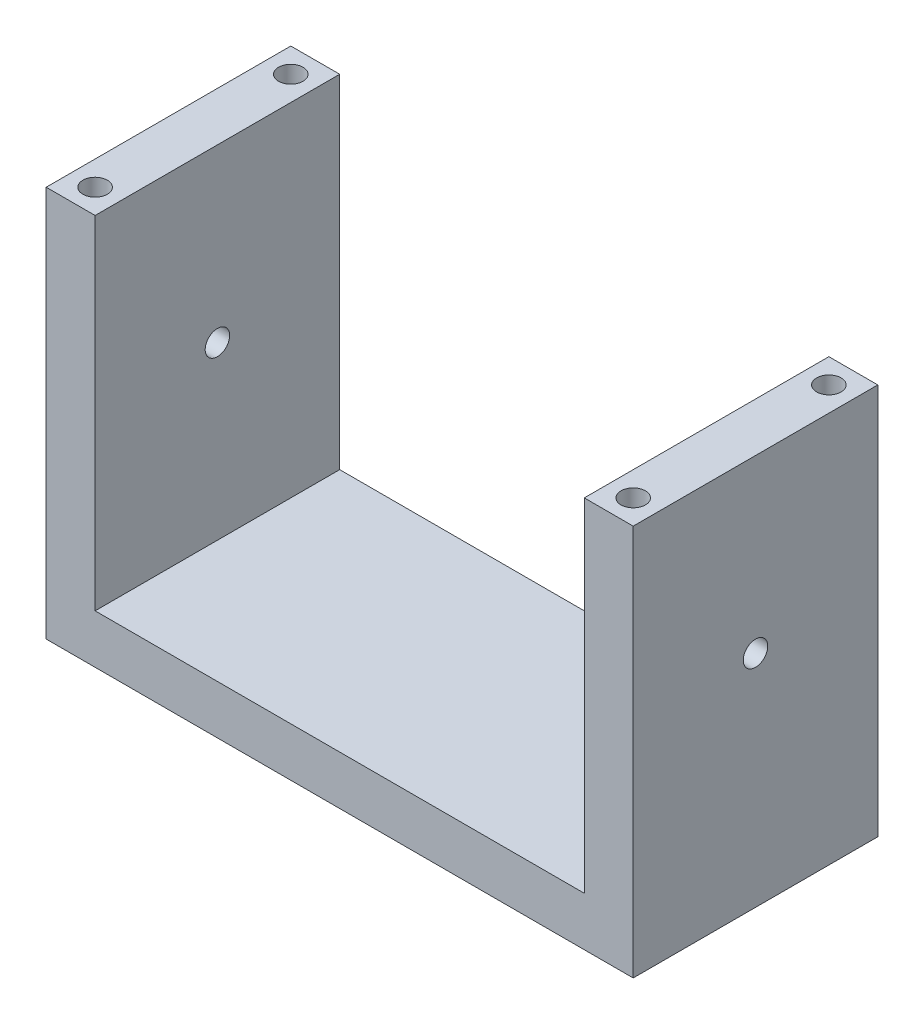
ISO-10303-21;
HEADER;
FILE_DESCRIPTION(('STEP AP214'),'2;1');
FILE_NAME('part.step','',(''),(''),'','','');
FILE_SCHEMA(('AUTOMOTIVE_DESIGN { 1 0 10303 214 1 1 1 1 }'));
ENDSEC;
DATA;
#1=APPLICATION_CONTEXT('core data for automotive mechanical design processes');
#2=APPLICATION_PROTOCOL_DEFINITION('international standard','automotive_design',2000,#1);
#3=PRODUCT_CONTEXT('',#1,'mechanical');
#4=PRODUCT('Part','Part','',(#3));
#5=PRODUCT_RELATED_PRODUCT_CATEGORY('part','',(#4));
#6=PRODUCT_DEFINITION_FORMATION('','',#4);
#7=PRODUCT_DEFINITION_CONTEXT('part definition',#1,'design');
#8=PRODUCT_DEFINITION('design','',#6,#7);
#9=PRODUCT_DEFINITION_SHAPE('','',#8);
#10=(LENGTH_UNIT() NAMED_UNIT(*) SI_UNIT(.MILLI.,.METRE.));
#11=(NAMED_UNIT(*) PLANE_ANGLE_UNIT() SI_UNIT($,.RADIAN.));
#12=(NAMED_UNIT(*) SI_UNIT($,.STERADIAN.) SOLID_ANGLE_UNIT());
#13=UNCERTAINTY_MEASURE_WITH_UNIT(LENGTH_MEASURE(1.E-05),#10,'distance_accuracy_value','');
#14=(GEOMETRIC_REPRESENTATION_CONTEXT(3) GLOBAL_UNCERTAINTY_ASSIGNED_CONTEXT((#13)) GLOBAL_UNIT_ASSIGNED_CONTEXT((#10,
#11,#12)) REPRESENTATION_CONTEXT('',''));
#15=CARTESIAN_POINT('',(0.,0.,0.));
#16=DIRECTION('',(0.,0.,1.));
#17=DIRECTION('',(1.,0.,0.));
#18=AXIS2_PLACEMENT_3D('',#15,#16,#17);
#19=CARTESIAN_POINT('',(-6.,0.,5.));
#20=DIRECTION('',(1.,0.,0.));
#21=DIRECTION('',(0.,0.,-1.));
#22=AXIS2_PLACEMENT_3D('',#19,#20,#21);
#23=PLANE('',#22);
#24=CARTESIAN_POINT('',(-6.,4.5,2.5));
#25=DIRECTION('',(1.,0.,0.));
#26=DIRECTION('',(0.,0.,-1.));
#27=AXIS2_PLACEMENT_3D('',#24,#25,#26);
#28=CIRCLE('',#27,0.25);
#29=CARTESIAN_POINT('',(-6.,4.5,2.25));
#30=VERTEX_POINT('',#29);
#31=EDGE_CURVE('E240',#30,#30,#28,.F.);
#32=ORIENTED_EDGE('',*,*,#31,.F.);
#33=EDGE_LOOP('',(#32));
#34=FACE_BOUND('',#33,.T.);
#35=DIRECTION('',(0.,-1.,0.));
#36=VECTOR('',#35,1.);
#37=CARTESIAN_POINT('',(-6.,0.,0.));
#38=LINE('',#37,#36);
#39=CARTESIAN_POINT('',(-6.,8.,0.));
#40=VERTEX_POINT('',#39);
#41=CARTESIAN_POINT('',(-6.,0.,0.));
#42=VERTEX_POINT('',#41);
#43=EDGE_CURVE('E144',#40,#42,#38,.T.);
#44=ORIENTED_EDGE('',*,*,#43,.T.);
#45=DIRECTION('',(0.,0.,-1.));
#46=VECTOR('',#45,1.);
#47=CARTESIAN_POINT('',(-6.,0.,5.));
#48=LINE('',#47,#46);
#49=CARTESIAN_POINT('',(-6.,0.,5.));
#50=VERTEX_POINT('',#49);
#51=EDGE_CURVE('E11',#50,#42,#48,.T.);
#52=ORIENTED_EDGE('',*,*,#51,.F.);
#53=DIRECTION('',(0.,-1.,0.));
#54=VECTOR('',#53,1.);
#55=CARTESIAN_POINT('',(-6.,0.,5.));
#56=LINE('',#55,#54);
#57=CARTESIAN_POINT('',(-6.,8.,5.));
#58=VERTEX_POINT('',#57);
#59=EDGE_CURVE('E167',#58,#50,#56,.T.);
#60=ORIENTED_EDGE('',*,*,#59,.F.);
#61=DIRECTION('',(0.,0.,-1.));
#62=VECTOR('',#61,1.);
#63=CARTESIAN_POINT('',(-6.,8.,5.));
#64=LINE('',#63,#62);
#65=EDGE_CURVE('E140',#58,#40,#64,.T.);
#66=ORIENTED_EDGE('',*,*,#65,.T.);
#67=EDGE_LOOP('',(#44,#52,#60,#66));
#68=FACE_BOUND('',#67,.T.);
#69=ADVANCED_FACE('F42',(#34,#68),#23,.F.);
#70=CARTESIAN_POINT('',(6.,0.,5.));
#71=DIRECTION('',(0.,1.,0.));
#72=DIRECTION('',(-1.,0.,0.));
#73=AXIS2_PLACEMENT_3D('',#70,#71,#72);
#74=PLANE('',#73);
#75=CARTESIAN_POINT('',(-5.5,0.,0.5));
#76=DIRECTION('',(0.,-1.,0.));
#77=DIRECTION('',(1.,0.,0.));
#78=AXIS2_PLACEMENT_3D('',#75,#76,#77);
#79=CIRCLE('',#78,0.25);
#80=CARTESIAN_POINT('',(-5.25,0.,0.5));
#81=VERTEX_POINT('',#80);
#82=EDGE_CURVE('E229',#81,#81,#79,.T.);
#83=ORIENTED_EDGE('',*,*,#82,.F.);
#84=EDGE_LOOP('',(#83));
#85=FACE_BOUND('',#84,.T.);
#86=CARTESIAN_POINT('',(5.5,0.,4.5));
#87=DIRECTION('',(0.,-1.,0.));
#88=DIRECTION('',(1.,0.,0.));
#89=AXIS2_PLACEMENT_3D('',#86,#87,#88);
#90=CIRCLE('',#89,0.25);
#91=CARTESIAN_POINT('',(5.75,0.,4.5));
#92=VERTEX_POINT('',#91);
#93=EDGE_CURVE('E220',#92,#92,#90,.T.);
#94=ORIENTED_EDGE('',*,*,#93,.F.);
#95=EDGE_LOOP('',(#94));
#96=FACE_BOUND('',#95,.T.);
#97=CARTESIAN_POINT('',(5.5,0.,0.5));
#98=DIRECTION('',(0.,-1.,0.));
#99=DIRECTION('',(1.,0.,0.));
#100=AXIS2_PLACEMENT_3D('',#97,#98,#99);
#101=CIRCLE('',#100,0.25);
#102=CARTESIAN_POINT('',(5.75,0.,0.5));
#103=VERTEX_POINT('',#102);
#104=EDGE_CURVE('E236',#103,#103,#101,.T.);
#105=ORIENTED_EDGE('',*,*,#104,.F.);
#106=EDGE_LOOP('',(#105));
#107=FACE_BOUND('',#106,.T.);
#108=CARTESIAN_POINT('',(-5.5,0.,4.5));
#109=DIRECTION('',(0.,-1.,0.));
#110=DIRECTION('',(1.,0.,0.));
#111=AXIS2_PLACEMENT_3D('',#108,#109,#110);
#112=CIRCLE('',#111,0.25);
#113=CARTESIAN_POINT('',(-5.25,0.,4.5));
#114=VERTEX_POINT('',#113);
#115=EDGE_CURVE('E212',#114,#114,#112,.T.);
#116=ORIENTED_EDGE('',*,*,#115,.F.);
#117=EDGE_LOOP('',(#116));
#118=FACE_BOUND('',#117,.T.);
#119=DIRECTION('',(1.,0.,0.));
#120=VECTOR('',#119,1.);
#121=CARTESIAN_POINT('',(6.,0.,0.));
#122=LINE('',#121,#120);
#123=CARTESIAN_POINT('',(6.,0.,0.));
#124=VERTEX_POINT('',#123);
#125=EDGE_CURVE('E148',#42,#124,#122,.T.);
#126=ORIENTED_EDGE('',*,*,#125,.T.);
#127=DIRECTION('',(0.,0.,-1.));
#128=VECTOR('',#127,1.);
#129=CARTESIAN_POINT('',(6.,0.,5.));
#130=LINE('',#129,#128);
#131=CARTESIAN_POINT('',(6.,0.,5.));
#132=VERTEX_POINT('',#131);
#133=EDGE_CURVE('E52',#132,#124,#130,.T.);
#134=ORIENTED_EDGE('',*,*,#133,.F.);
#135=DIRECTION('',(1.,0.,0.));
#136=VECTOR('',#135,1.);
#137=CARTESIAN_POINT('',(6.,0.,5.));
#138=LINE('',#137,#136);
#139=EDGE_CURVE('E103',#50,#132,#138,.T.);
#140=ORIENTED_EDGE('',*,*,#139,.F.);
#141=ORIENTED_EDGE('',*,*,#51,.T.);
#142=EDGE_LOOP('',(#126,#134,#140,#141));
#143=FACE_BOUND('',#142,.T.);
#144=ADVANCED_FACE('F276',(#85,#96,#107,#118,#143),#74,.F.);
#145=CARTESIAN_POINT('',(6.,8.,5.));
#146=DIRECTION('',(-1.,0.,0.));
#147=DIRECTION('',(0.,-1.,0.));
#148=AXIS2_PLACEMENT_3D('',#145,#146,#147);
#149=PLANE('',#148);
#150=CARTESIAN_POINT('',(6.,4.5,2.5));
#151=DIRECTION('',(-1.,0.,0.));
#152=DIRECTION('',(0.,-1.,0.));
#153=AXIS2_PLACEMENT_3D('',#150,#151,#152);
#154=CIRCLE('',#153,0.25);
#155=CARTESIAN_POINT('',(6.,4.25,2.5));
#156=VERTEX_POINT('',#155);
#157=EDGE_CURVE('E247',#156,#156,#154,.F.);
#158=ORIENTED_EDGE('',*,*,#157,.F.);
#159=EDGE_LOOP('',(#158));
#160=FACE_BOUND('',#159,.T.);
#161=DIRECTION('',(0.,1.,0.));
#162=VECTOR('',#161,1.);
#163=CARTESIAN_POINT('',(6.,8.,0.));
#164=LINE('',#163,#162);
#165=CARTESIAN_POINT('',(6.,8.,0.));
#166=VERTEX_POINT('',#165);
#167=EDGE_CURVE('E152',#124,#166,#164,.T.);
#168=ORIENTED_EDGE('',*,*,#167,.T.);
#169=DIRECTION('',(0.,0.,-1.));
#170=VECTOR('',#169,1.);
#171=CARTESIAN_POINT('',(6.,8.,5.));
#172=LINE('',#171,#170);
#173=CARTESIAN_POINT('',(6.,8.,5.));
#174=VERTEX_POINT('',#173);
#175=EDGE_CURVE('E178',#174,#166,#172,.T.);
#176=ORIENTED_EDGE('',*,*,#175,.F.);
#177=DIRECTION('',(0.,1.,0.));
#178=VECTOR('',#177,1.);
#179=CARTESIAN_POINT('',(6.,8.,5.));
#180=LINE('',#179,#178);
#181=EDGE_CURVE('E189',#132,#174,#180,.T.);
#182=ORIENTED_EDGE('',*,*,#181,.F.);
#183=ORIENTED_EDGE('',*,*,#133,.T.);
#184=EDGE_LOOP('',(#168,#176,#182,#183));
#185=FACE_BOUND('',#184,.T.);
#186=ADVANCED_FACE('F187',(#160,#185),#149,.F.);
#187=CARTESIAN_POINT('',(5.,8.,5.));
#188=DIRECTION('',(0.,-1.,0.));
#189=DIRECTION('',(0.,0.,-1.));
#190=AXIS2_PLACEMENT_3D('',#187,#188,#189);
#191=PLANE('',#190);
#192=CARTESIAN_POINT('',(5.5,8.,4.5));
#193=DIRECTION('',(0.,-1.,0.));
#194=DIRECTION('',(1.,0.,0.));
#195=AXIS2_PLACEMENT_3D('',#192,#193,#194);
#196=CIRCLE('',#195,0.25);
#197=CARTESIAN_POINT('',(5.75,8.,4.5));
#198=VERTEX_POINT('',#197);
#199=EDGE_CURVE('E224',#198,#198,#196,.T.);
#200=ORIENTED_EDGE('',*,*,#199,.T.);
#201=EDGE_LOOP('',(#200));
#202=FACE_BOUND('',#201,.T.);
#203=CARTESIAN_POINT('',(5.5,8.,0.5));
#204=DIRECTION('',(0.,-1.,0.));
#205=DIRECTION('',(1.,0.,0.));
#206=AXIS2_PLACEMENT_3D('',#203,#204,#205);
#207=CIRCLE('',#206,0.25);
#208=CARTESIAN_POINT('',(5.75,8.,0.5));
#209=VERTEX_POINT('',#208);
#210=EDGE_CURVE('E225',#209,#209,#207,.T.);
#211=ORIENTED_EDGE('',*,*,#210,.T.);
#212=EDGE_LOOP('',(#211));
#213=FACE_BOUND('',#212,.T.);
#214=DIRECTION('',(-1.,0.,0.));
#215=VECTOR('',#214,1.);
#216=CARTESIAN_POINT('',(5.,8.,0.));
#217=LINE('',#216,#215);
#218=CARTESIAN_POINT('',(5.,8.,0.));
#219=VERTEX_POINT('',#218);
#220=EDGE_CURVE('E155',#166,#219,#217,.T.);
#221=ORIENTED_EDGE('',*,*,#220,.T.);
#222=DIRECTION('',(0.,0.,-1.));
#223=VECTOR('',#222,1.);
#224=CARTESIAN_POINT('',(5.,8.,5.));
#225=LINE('',#224,#223);
#226=CARTESIAN_POINT('',(5.,8.,5.));
#227=VERTEX_POINT('',#226);
#228=EDGE_CURVE('E174',#227,#219,#225,.T.);
#229=ORIENTED_EDGE('',*,*,#228,.F.);
#230=DIRECTION('',(-1.,0.,0.));
#231=VECTOR('',#230,1.);
#232=CARTESIAN_POINT('',(5.,8.,5.));
#233=LINE('',#232,#231);
#234=EDGE_CURVE('E202',#174,#227,#233,.T.);
#235=ORIENTED_EDGE('',*,*,#234,.F.);
#236=ORIENTED_EDGE('',*,*,#175,.T.);
#237=EDGE_LOOP('',(#221,#229,#235,#236));
#238=FACE_BOUND('',#237,.T.);
#239=ADVANCED_FACE('F197',(#202,#213,#238),#191,.F.);
#240=CARTESIAN_POINT('',(5.,1.,5.));
#241=DIRECTION('',(1.,0.,0.));
#242=DIRECTION('',(0.,0.,-1.));
#243=AXIS2_PLACEMENT_3D('',#240,#241,#242);
#244=PLANE('',#243);
#245=CARTESIAN_POINT('',(5.,4.5,2.5));
#246=DIRECTION('',(1.,0.,0.));
#247=DIRECTION('',(0.,0.,-1.));
#248=AXIS2_PLACEMENT_3D('',#245,#246,#247);
#249=CIRCLE('',#248,0.25);
#250=CARTESIAN_POINT('',(5.,4.5,2.25));
#251=VERTEX_POINT('',#250);
#252=EDGE_CURVE('E251',#251,#251,#249,.F.);
#253=ORIENTED_EDGE('',*,*,#252,.F.);
#254=EDGE_LOOP('',(#253));
#255=FACE_BOUND('',#254,.T.);
#256=DIRECTION('',(0.,-1.,0.));
#257=VECTOR('',#256,1.);
#258=CARTESIAN_POINT('',(5.,1.,0.));
#259=LINE('',#258,#257);
#260=CARTESIAN_POINT('',(5.,1.,0.));
#261=VERTEX_POINT('',#260);
#262=EDGE_CURVE('E158',#219,#261,#259,.T.);
#263=ORIENTED_EDGE('',*,*,#262,.T.);
#264=DIRECTION('',(0.,0.,-1.));
#265=VECTOR('',#264,1.);
#266=CARTESIAN_POINT('',(5.,1.,5.));
#267=LINE('',#266,#265);
#268=CARTESIAN_POINT('',(5.,1.,5.));
#269=VERTEX_POINT('',#268);
#270=EDGE_CURVE('E133',#269,#261,#267,.T.);
#271=ORIENTED_EDGE('',*,*,#270,.F.);
#272=DIRECTION('',(0.,-1.,0.));
#273=VECTOR('',#272,1.);
#274=CARTESIAN_POINT('',(5.,1.,5.));
#275=LINE('',#274,#273);
#276=EDGE_CURVE('E122',#227,#269,#275,.T.);
#277=ORIENTED_EDGE('',*,*,#276,.F.);
#278=ORIENTED_EDGE('',*,*,#228,.T.);
#279=EDGE_LOOP('',(#263,#271,#277,#278));
#280=FACE_BOUND('',#279,.T.);
#281=ADVANCED_FACE('F200',(#255,#280),#244,.F.);
#282=CARTESIAN_POINT('',(-5.,1.,5.));
#283=DIRECTION('',(0.,-1.,0.));
#284=DIRECTION('',(0.,0.,-1.));
#285=AXIS2_PLACEMENT_3D('',#282,#283,#284);
#286=PLANE('',#285);
#287=DIRECTION('',(-1.,0.,0.));
#288=VECTOR('',#287,1.);
#289=CARTESIAN_POINT('',(-5.,1.,0.));
#290=LINE('',#289,#288);
#291=CARTESIAN_POINT('',(-5.,1.,0.));
#292=VERTEX_POINT('',#291);
#293=EDGE_CURVE('E131',#261,#292,#290,.T.);
#294=ORIENTED_EDGE('',*,*,#293,.T.);
#295=DIRECTION('',(0.,0.,-1.));
#296=VECTOR('',#295,1.);
#297=CARTESIAN_POINT('',(-5.,1.,5.));
#298=LINE('',#297,#296);
#299=CARTESIAN_POINT('',(-5.,1.,5.));
#300=VERTEX_POINT('',#299);
#301=EDGE_CURVE('E128',#300,#292,#298,.T.);
#302=ORIENTED_EDGE('',*,*,#301,.F.);
#303=DIRECTION('',(-1.,0.,0.));
#304=VECTOR('',#303,1.);
#305=CARTESIAN_POINT('',(-5.,1.,5.));
#306=LINE('',#305,#304);
#307=EDGE_CURVE('E116',#269,#300,#306,.T.);
#308=ORIENTED_EDGE('',*,*,#307,.F.);
#309=ORIENTED_EDGE('',*,*,#270,.T.);
#310=EDGE_LOOP('',(#294,#302,#308,#309));
#311=FACE_BOUND('',#310,.T.);
#312=ADVANCED_FACE('F129',(#311),#286,.F.);
#313=CARTESIAN_POINT('',(-5.,8.,5.));
#314=DIRECTION('',(-1.,0.,0.));
#315=DIRECTION('',(0.,-1.,0.));
#316=AXIS2_PLACEMENT_3D('',#313,#314,#315);
#317=PLANE('',#316);
#318=CARTESIAN_POINT('',(-5.,4.5,2.5));
#319=DIRECTION('',(-1.,0.,0.));
#320=DIRECTION('',(0.,-1.,0.));
#321=AXIS2_PLACEMENT_3D('',#318,#319,#320);
#322=CIRCLE('',#321,0.25);
#323=CARTESIAN_POINT('',(-5.,4.25,2.5));
#324=VERTEX_POINT('',#323);
#325=EDGE_CURVE('E45',#324,#324,#322,.F.);
#326=ORIENTED_EDGE('',*,*,#325,.F.);
#327=EDGE_LOOP('',(#326));
#328=FACE_BOUND('',#327,.T.);
#329=DIRECTION('',(0.,1.,0.));
#330=VECTOR('',#329,1.);
#331=CARTESIAN_POINT('',(-5.,8.,0.));
#332=LINE('',#331,#330);
#333=CARTESIAN_POINT('',(-5.,8.,0.));
#334=VERTEX_POINT('',#333);
#335=EDGE_CURVE('E89',#292,#334,#332,.T.);
#336=ORIENTED_EDGE('',*,*,#335,.T.);
#337=DIRECTION('',(0.,0.,-1.));
#338=VECTOR('',#337,1.);
#339=CARTESIAN_POINT('',(-5.,8.,5.));
#340=LINE('',#339,#338);
#341=CARTESIAN_POINT('',(-5.,8.,5.));
#342=VERTEX_POINT('',#341);
#343=EDGE_CURVE('E134',#342,#334,#340,.T.);
#344=ORIENTED_EDGE('',*,*,#343,.F.);
#345=DIRECTION('',(0.,1.,0.));
#346=VECTOR('',#345,1.);
#347=CARTESIAN_POINT('',(-5.,8.,5.));
#348=LINE('',#347,#346);
#349=EDGE_CURVE('E120',#300,#342,#348,.T.);
#350=ORIENTED_EDGE('',*,*,#349,.F.);
#351=ORIENTED_EDGE('',*,*,#301,.T.);
#352=EDGE_LOOP('',(#336,#344,#350,#351));
#353=FACE_BOUND('',#352,.T.);
#354=ADVANCED_FACE('F136',(#328,#353),#317,.F.);
#355=CARTESIAN_POINT('',(-6.,8.,5.));
#356=DIRECTION('',(0.,-1.,0.));
#357=DIRECTION('',(0.,0.,-1.));
#358=AXIS2_PLACEMENT_3D('',#355,#356,#357);
#359=PLANE('',#358);
#360=CARTESIAN_POINT('',(-5.5,8.,0.5));
#361=DIRECTION('',(0.,-1.,0.));
#362=DIRECTION('',(1.,0.,0.));
#363=AXIS2_PLACEMENT_3D('',#360,#361,#362);
#364=CIRCLE('',#363,0.25);
#365=CARTESIAN_POINT('',(-5.25,8.,0.5));
#366=VERTEX_POINT('',#365);
#367=EDGE_CURVE('E216',#366,#366,#364,.T.);
#368=ORIENTED_EDGE('',*,*,#367,.T.);
#369=EDGE_LOOP('',(#368));
#370=FACE_BOUND('',#369,.T.);
#371=CARTESIAN_POINT('',(-5.5,8.,4.5));
#372=DIRECTION('',(0.,-1.,0.));
#373=DIRECTION('',(1.,0.,0.));
#374=AXIS2_PLACEMENT_3D('',#371,#372,#373);
#375=CIRCLE('',#374,0.25);
#376=CARTESIAN_POINT('',(-5.25,8.,4.5));
#377=VERTEX_POINT('',#376);
#378=EDGE_CURVE('E149',#377,#377,#375,.T.);
#379=ORIENTED_EDGE('',*,*,#378,.T.);
#380=EDGE_LOOP('',(#379));
#381=FACE_BOUND('',#380,.T.);
#382=DIRECTION('',(-1.,0.,0.));
#383=VECTOR('',#382,1.);
#384=CARTESIAN_POINT('',(-6.,8.,0.));
#385=LINE('',#384,#383);
#386=EDGE_CURVE('E95',#334,#40,#385,.T.);
#387=ORIENTED_EDGE('',*,*,#386,.T.);
#388=ORIENTED_EDGE('',*,*,#65,.F.);
#389=DIRECTION('',(-1.,0.,0.));
#390=VECTOR('',#389,1.);
#391=CARTESIAN_POINT('',(-6.,8.,5.));
#392=LINE('',#391,#390);
#393=EDGE_CURVE('E60',#342,#58,#392,.T.);
#394=ORIENTED_EDGE('',*,*,#393,.F.);
#395=ORIENTED_EDGE('',*,*,#343,.T.);
#396=EDGE_LOOP('',(#387,#388,#394,#395));
#397=FACE_BOUND('',#396,.T.);
#398=ADVANCED_FACE('F264',(#370,#381,#397),#359,.F.);
#399=CARTESIAN_POINT('',(0.,0.,5.));
#400=DIRECTION('',(0.,0.,-1.));
#401=DIRECTION('',(-1.,0.,0.));
#402=AXIS2_PLACEMENT_3D('',#399,#400,#401);
#403=PLANE('',#402);
#404=ORIENTED_EDGE('',*,*,#59,.T.);
#405=ORIENTED_EDGE('',*,*,#139,.T.);
#406=ORIENTED_EDGE('',*,*,#181,.T.);
#407=ORIENTED_EDGE('',*,*,#234,.T.);
#408=ORIENTED_EDGE('',*,*,#276,.T.);
#409=ORIENTED_EDGE('',*,*,#307,.T.);
#410=ORIENTED_EDGE('',*,*,#349,.T.);
#411=ORIENTED_EDGE('',*,*,#393,.T.);
#412=EDGE_LOOP('',(#404,#405,#406,#407,#408,#409,#410,#411));
#413=FACE_BOUND('',#412,.T.);
#414=ADVANCED_FACE('F118',(#413),#403,.F.);
#415=CARTESIAN_POINT('',(0.,0.,0.));
#416=DIRECTION('',(0.,0.,-1.));
#417=DIRECTION('',(-1.,0.,0.));
#418=AXIS2_PLACEMENT_3D('',#415,#416,#417);
#419=PLANE('',#418);
#420=ORIENTED_EDGE('',*,*,#43,.F.);
#421=ORIENTED_EDGE('',*,*,#386,.F.);
#422=ORIENTED_EDGE('',*,*,#335,.F.);
#423=ORIENTED_EDGE('',*,*,#293,.F.);
#424=ORIENTED_EDGE('',*,*,#262,.F.);
#425=ORIENTED_EDGE('',*,*,#220,.F.);
#426=ORIENTED_EDGE('',*,*,#167,.F.);
#427=ORIENTED_EDGE('',*,*,#125,.F.);
#428=EDGE_LOOP('',(#420,#421,#422,#423,#424,#425,#426,#427));
#429=FACE_BOUND('',#428,.T.);
#430=ADVANCED_FACE('F193',(#429),#419,.T.);
#431=CARTESIAN_POINT('',(-5.5,8.,4.5));
#432=DIRECTION('',(0.,-1.,0.));
#433=DIRECTION('',(1.,0.,0.));
#434=AXIS2_PLACEMENT_3D('',#431,#432,#433);
#435=CYLINDRICAL_SURFACE('',#434,0.25);
#436=ORIENTED_EDGE('',*,*,#378,.F.);
#437=EDGE_LOOP('',(#436));
#438=FACE_BOUND('',#437,.T.);
#439=ORIENTED_EDGE('',*,*,#115,.T.);
#440=EDGE_LOOP('',(#439));
#441=FACE_BOUND('',#440,.T.);
#442=ADVANCED_FACE('F304',(#438,#441),#435,.F.);
#443=CARTESIAN_POINT('',(-5.5,8.,0.5));
#444=DIRECTION('',(0.,-1.,0.));
#445=DIRECTION('',(1.,0.,0.));
#446=AXIS2_PLACEMENT_3D('',#443,#444,#445);
#447=CYLINDRICAL_SURFACE('',#446,0.25);
#448=ORIENTED_EDGE('',*,*,#367,.F.);
#449=EDGE_LOOP('',(#448));
#450=FACE_BOUND('',#449,.T.);
#451=ORIENTED_EDGE('',*,*,#82,.T.);
#452=EDGE_LOOP('',(#451));
#453=FACE_BOUND('',#452,.T.);
#454=ADVANCED_FACE('F301',(#450,#453),#447,.F.);
#455=CARTESIAN_POINT('',(5.5,8.,0.5));
#456=DIRECTION('',(0.,-1.,0.));
#457=DIRECTION('',(1.,0.,0.));
#458=AXIS2_PLACEMENT_3D('',#455,#456,#457);
#459=CYLINDRICAL_SURFACE('',#458,0.25);
#460=ORIENTED_EDGE('',*,*,#210,.F.);
#461=EDGE_LOOP('',(#460));
#462=FACE_BOUND('',#461,.T.);
#463=ORIENTED_EDGE('',*,*,#104,.T.);
#464=EDGE_LOOP('',(#463));
#465=FACE_BOUND('',#464,.T.);
#466=ADVANCED_FACE('F295',(#462,#465),#459,.F.);
#467=CARTESIAN_POINT('',(5.5,8.,4.5));
#468=DIRECTION('',(0.,-1.,0.));
#469=DIRECTION('',(1.,0.,0.));
#470=AXIS2_PLACEMENT_3D('',#467,#468,#469);
#471=CYLINDRICAL_SURFACE('',#470,0.25);
#472=ORIENTED_EDGE('',*,*,#199,.F.);
#473=EDGE_LOOP('',(#472));
#474=FACE_BOUND('',#473,.T.);
#475=ORIENTED_EDGE('',*,*,#93,.T.);
#476=EDGE_LOOP('',(#475));
#477=FACE_BOUND('',#476,.T.);
#478=ADVANCED_FACE('F290',(#474,#477),#471,.F.);
#479=CARTESIAN_POINT('',(10.,4.5,2.5));
#480=DIRECTION('',(-1.,0.,0.));
#481=DIRECTION('',(0.,0.,1.));
#482=AXIS2_PLACEMENT_3D('',#479,#480,#481);
#483=CYLINDRICAL_SURFACE('',#482,0.25);
#484=ORIENTED_EDGE('',*,*,#325,.T.);
#485=EDGE_LOOP('',(#484));
#486=FACE_BOUND('',#485,.T.);
#487=ORIENTED_EDGE('',*,*,#31,.T.);
#488=EDGE_LOOP('',(#487));
#489=FACE_BOUND('',#488,.T.);
#490=ADVANCED_FACE('F260',(#486,#489),#483,.F.);
#491=ORIENTED_EDGE('',*,*,#252,.T.);
#492=EDGE_LOOP('',(#491));
#493=FACE_BOUND('',#492,.T.);
#494=ORIENTED_EDGE('',*,*,#157,.T.);
#495=EDGE_LOOP('',(#494));
#496=FACE_BOUND('',#495,.T.);
#497=ADVANCED_FACE('F289',(#493,#496),#483,.F.);
#498=CLOSED_SHELL('',(#69,#144,#186,#239,#281,#312,#354,#398,#414,#430,#442,#454,#466,#478,#490,#497));
#499=MANIFOLD_SOLID_BREP('B2',#498);
#500=ADVANCED_BREP_SHAPE_REPRESENTATION('',(#18,#499),#14);
#501=SHAPE_DEFINITION_REPRESENTATION(#9,#500);
ENDSEC;
END-ISO-10303-21;
